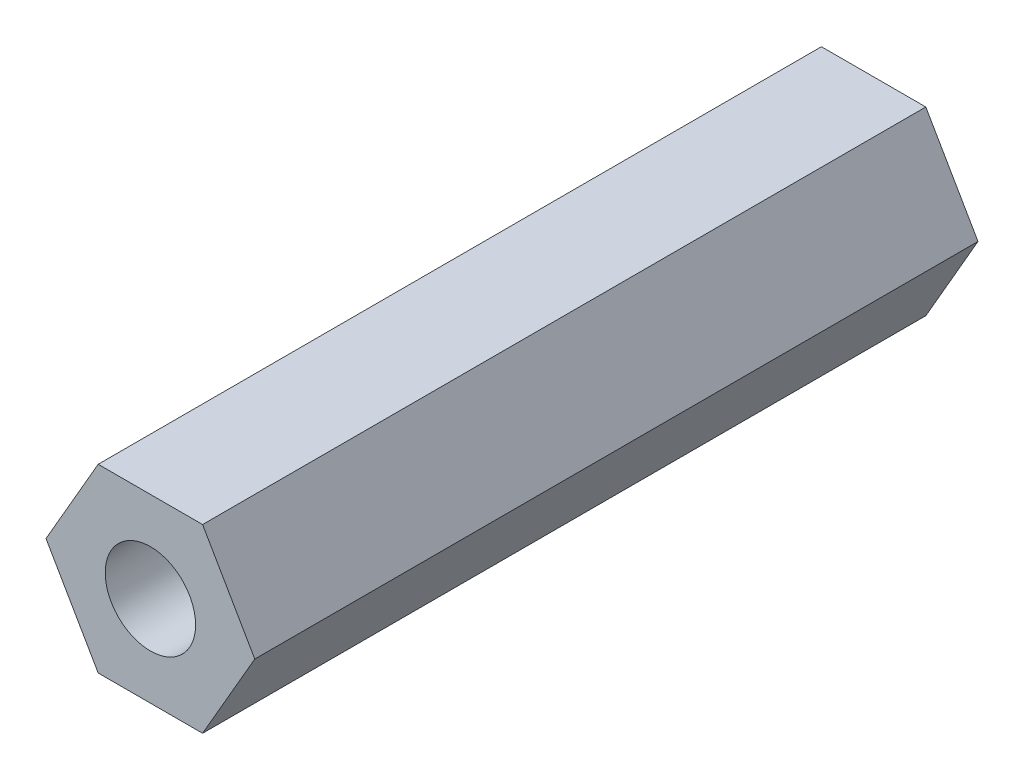
ISO-10303-21;
HEADER;
FILE_DESCRIPTION(('STEP AP214'),'2;1');
FILE_NAME('part.step','',(''),(''),'','','');
FILE_SCHEMA(('AUTOMOTIVE_DESIGN { 1 0 10303 214 1 1 1 1 }'));
ENDSEC;
DATA;
#1=APPLICATION_CONTEXT('core data for automotive mechanical design processes');
#2=APPLICATION_PROTOCOL_DEFINITION('international standard','automotive_design',2000,#1);
#3=PRODUCT_CONTEXT('',#1,'mechanical');
#4=PRODUCT('Part','Part','',(#3));
#5=PRODUCT_RELATED_PRODUCT_CATEGORY('part','',(#4));
#6=PRODUCT_DEFINITION_FORMATION('','',#4);
#7=PRODUCT_DEFINITION_CONTEXT('part definition',#1,'design');
#8=PRODUCT_DEFINITION('design','',#6,#7);
#9=PRODUCT_DEFINITION_SHAPE('','',#8);
#10=(LENGTH_UNIT() NAMED_UNIT(*) SI_UNIT(.MILLI.,.METRE.));
#11=(NAMED_UNIT(*) PLANE_ANGLE_UNIT() SI_UNIT($,.RADIAN.));
#12=(NAMED_UNIT(*) SI_UNIT($,.STERADIAN.) SOLID_ANGLE_UNIT());
#13=UNCERTAINTY_MEASURE_WITH_UNIT(LENGTH_MEASURE(1.E-05),#10,'distance_accuracy_value','');
#14=(GEOMETRIC_REPRESENTATION_CONTEXT(3) GLOBAL_UNCERTAINTY_ASSIGNED_CONTEXT((#13)) GLOBAL_UNIT_ASSIGNED_CONTEXT((#10,
#11,#12)) REPRESENTATION_CONTEXT('',''));
#15=CARTESIAN_POINT('',(0.,0.,0.));
#16=DIRECTION('',(0.,0.,1.));
#17=DIRECTION('',(1.,0.,0.));
#18=AXIS2_PLACEMENT_3D('',#15,#16,#17);
#19=CARTESIAN_POINT('',(1.44337567297406,2.5,20.));
#20=DIRECTION('',(0.,-1.,0.));
#21=DIRECTION('',(1.,0.,0.));
#22=AXIS2_PLACEMENT_3D('',#19,#20,#21);
#23=PLANE('',#22);
#24=DIRECTION('',(-1.,0.,0.));
#25=VECTOR('',#24,1.);
#26=CARTESIAN_POINT('',(1.44337567297406,2.5,0.));
#27=LINE('',#26,#25);
#28=CARTESIAN_POINT('',(1.44337567297406,2.5,0.));
#29=VERTEX_POINT('',#28);
#30=CARTESIAN_POINT('',(-1.44337567297407,2.5,0.));
#31=VERTEX_POINT('',#30);
#32=EDGE_CURVE('E116',#29,#31,#27,.T.);
#33=ORIENTED_EDGE('',*,*,#32,.T.);
#34=DIRECTION('',(0.,0.,-1.));
#35=VECTOR('',#34,1.);
#36=CARTESIAN_POINT('',(-1.44337567297407,2.5,20.));
#37=LINE('',#36,#35);
#38=CARTESIAN_POINT('',(-1.44337567297407,2.5,20.));
#39=VERTEX_POINT('',#38);
#40=EDGE_CURVE('E11',#39,#31,#37,.T.);
#41=ORIENTED_EDGE('',*,*,#40,.F.);
#42=DIRECTION('',(-1.,0.,0.));
#43=VECTOR('',#42,1.);
#44=CARTESIAN_POINT('',(1.44337567297406,2.5,20.));
#45=LINE('',#44,#43);
#46=CARTESIAN_POINT('',(1.44337567297406,2.5,20.));
#47=VERTEX_POINT('',#46);
#48=EDGE_CURVE('E127',#47,#39,#45,.T.);
#49=ORIENTED_EDGE('',*,*,#48,.F.);
#50=DIRECTION('',(0.,0.,-1.));
#51=VECTOR('',#50,1.);
#52=CARTESIAN_POINT('',(1.44337567297406,2.5,20.));
#53=LINE('',#52,#51);
#54=EDGE_CURVE('E112',#47,#29,#53,.T.);
#55=ORIENTED_EDGE('',*,*,#54,.T.);
#56=EDGE_LOOP('',(#33,#41,#49,#55));
#57=FACE_BOUND('',#56,.T.);
#58=ADVANCED_FACE('F32',(#57),#23,.F.);
#59=CARTESIAN_POINT('',(-1.44337567297407,2.5,20.));
#60=DIRECTION('',(0.866025403784439,-0.5,0.));
#61=DIRECTION('',(0.5,0.866025403784439,0.));
#62=AXIS2_PLACEMENT_3D('',#59,#60,#61);
#63=PLANE('',#62);
#64=DIRECTION('',(-0.5,-0.866025403784439,0.));
#65=VECTOR('',#64,1.);
#66=CARTESIAN_POINT('',(-1.44337567297407,2.5,0.));
#67=LINE('',#66,#65);
#68=CARTESIAN_POINT('',(-2.88675134594813,0.,0.));
#69=VERTEX_POINT('',#68);
#70=EDGE_CURVE('E119',#31,#69,#67,.T.);
#71=ORIENTED_EDGE('',*,*,#70,.T.);
#72=DIRECTION('',(0.,0.,-1.));
#73=VECTOR('',#72,1.);
#74=CARTESIAN_POINT('',(-2.88675134594813,0.,20.));
#75=LINE('',#74,#73);
#76=CARTESIAN_POINT('',(-2.88675134594813,0.,20.));
#77=VERTEX_POINT('',#76);
#78=EDGE_CURVE('E40',#77,#69,#75,.T.);
#79=ORIENTED_EDGE('',*,*,#78,.F.);
#80=DIRECTION('',(-0.5,-0.866025403784439,0.));
#81=VECTOR('',#80,1.);
#82=CARTESIAN_POINT('',(-1.44337567297407,2.5,20.));
#83=LINE('',#82,#81);
#84=EDGE_CURVE('E85',#39,#77,#83,.T.);
#85=ORIENTED_EDGE('',*,*,#84,.F.);
#86=ORIENTED_EDGE('',*,*,#40,.T.);
#87=EDGE_LOOP('',(#71,#79,#85,#86));
#88=FACE_BOUND('',#87,.T.);
#89=ADVANCED_FACE('F152',(#88),#63,.F.);
#90=CARTESIAN_POINT('',(-2.88675134594813,0.,20.));
#91=DIRECTION('',(0.866025403784438,0.5,0.));
#92=DIRECTION('',(-0.5,0.866025403784438,0.));
#93=AXIS2_PLACEMENT_3D('',#90,#91,#92);
#94=PLANE('',#93);
#95=DIRECTION('',(0.5,-0.866025403784438,0.));
#96=VECTOR('',#95,1.);
#97=CARTESIAN_POINT('',(-2.88675134594813,0.,0.));
#98=LINE('',#97,#96);
#99=CARTESIAN_POINT('',(-1.44337567297406,-2.5,0.));
#100=VERTEX_POINT('',#99);
#101=EDGE_CURVE('E122',#69,#100,#98,.T.);
#102=ORIENTED_EDGE('',*,*,#101,.T.);
#103=DIRECTION('',(0.,0.,-1.));
#104=VECTOR('',#103,1.);
#105=CARTESIAN_POINT('',(-1.44337567297406,-2.5,20.));
#106=LINE('',#105,#104);
#107=CARTESIAN_POINT('',(-1.44337567297406,-2.5,20.));
#108=VERTEX_POINT('',#107);
#109=EDGE_CURVE('E107',#108,#100,#106,.T.);
#110=ORIENTED_EDGE('',*,*,#109,.F.);
#111=DIRECTION('',(0.5,-0.866025403784438,0.));
#112=VECTOR('',#111,1.);
#113=CARTESIAN_POINT('',(-2.88675134594813,0.,20.));
#114=LINE('',#113,#112);
#115=EDGE_CURVE('E98',#77,#108,#114,.T.);
#116=ORIENTED_EDGE('',*,*,#115,.F.);
#117=ORIENTED_EDGE('',*,*,#78,.T.);
#118=EDGE_LOOP('',(#102,#110,#116,#117));
#119=FACE_BOUND('',#118,.T.);
#120=ADVANCED_FACE('F133',(#119),#94,.F.);
#121=CARTESIAN_POINT('',(-1.44337567297406,-2.5,20.));
#122=DIRECTION('',(0.,1.,0.));
#123=DIRECTION('',(-1.,0.,0.));
#124=AXIS2_PLACEMENT_3D('',#121,#122,#123);
#125=PLANE('',#124);
#126=DIRECTION('',(1.,0.,0.));
#127=VECTOR('',#126,1.);
#128=CARTESIAN_POINT('',(-1.44337567297406,-2.5,0.));
#129=LINE('',#128,#127);
#130=CARTESIAN_POINT('',(1.44337567297407,-2.5,0.));
#131=VERTEX_POINT('',#130);
#132=EDGE_CURVE('E106',#100,#131,#129,.T.);
#133=ORIENTED_EDGE('',*,*,#132,.T.);
#134=DIRECTION('',(0.,0.,-1.));
#135=VECTOR('',#134,1.);
#136=CARTESIAN_POINT('',(1.44337567297407,-2.5,20.));
#137=LINE('',#136,#135);
#138=CARTESIAN_POINT('',(1.44337567297407,-2.5,20.));
#139=VERTEX_POINT('',#138);
#140=EDGE_CURVE('E103',#139,#131,#137,.T.);
#141=ORIENTED_EDGE('',*,*,#140,.F.);
#142=DIRECTION('',(1.,0.,0.));
#143=VECTOR('',#142,1.);
#144=CARTESIAN_POINT('',(-1.44337567297406,-2.5,20.));
#145=LINE('',#144,#143);
#146=EDGE_CURVE('E92',#108,#139,#145,.T.);
#147=ORIENTED_EDGE('',*,*,#146,.F.);
#148=ORIENTED_EDGE('',*,*,#109,.T.);
#149=EDGE_LOOP('',(#133,#141,#147,#148));
#150=FACE_BOUND('',#149,.T.);
#151=ADVANCED_FACE('F104',(#150),#125,.F.);
#152=CARTESIAN_POINT('',(1.44337567297407,-2.5,20.));
#153=DIRECTION('',(-0.866025403784439,0.5,0.));
#154=DIRECTION('',(-0.5,-0.866025403784439,0.));
#155=AXIS2_PLACEMENT_3D('',#152,#153,#154);
#156=PLANE('',#155);
#157=DIRECTION('',(0.5,0.866025403784439,0.));
#158=VECTOR('',#157,1.);
#159=CARTESIAN_POINT('',(1.44337567297407,-2.5,0.));
#160=LINE('',#159,#158);
#161=CARTESIAN_POINT('',(2.88675134594813,0.,0.));
#162=VERTEX_POINT('',#161);
#163=EDGE_CURVE('E71',#131,#162,#160,.T.);
#164=ORIENTED_EDGE('',*,*,#163,.T.);
#165=DIRECTION('',(0.,0.,-1.));
#166=VECTOR('',#165,1.);
#167=CARTESIAN_POINT('',(2.88675134594813,0.,20.));
#168=LINE('',#167,#166);
#169=CARTESIAN_POINT('',(2.88675134594813,0.,20.));
#170=VERTEX_POINT('',#169);
#171=EDGE_CURVE('E108',#170,#162,#168,.T.);
#172=ORIENTED_EDGE('',*,*,#171,.F.);
#173=DIRECTION('',(0.5,0.866025403784439,0.));
#174=VECTOR('',#173,1.);
#175=CARTESIAN_POINT('',(1.44337567297407,-2.5,20.));
#176=LINE('',#175,#174);
#177=EDGE_CURVE('E96',#139,#170,#176,.T.);
#178=ORIENTED_EDGE('',*,*,#177,.F.);
#179=ORIENTED_EDGE('',*,*,#140,.T.);
#180=EDGE_LOOP('',(#164,#172,#178,#179));
#181=FACE_BOUND('',#180,.T.);
#182=ADVANCED_FACE('F110',(#181),#156,.F.);
#183=CARTESIAN_POINT('',(2.88675134594813,0.,20.));
#184=DIRECTION('',(-0.866025403784439,-0.5,0.));
#185=DIRECTION('',(0.5,-0.866025403784439,0.));
#186=AXIS2_PLACEMENT_3D('',#183,#184,#185);
#187=PLANE('',#186);
#188=DIRECTION('',(-0.5,0.866025403784439,0.));
#189=VECTOR('',#188,1.);
#190=CARTESIAN_POINT('',(2.88675134594813,0.,0.));
#191=LINE('',#190,#189);
#192=EDGE_CURVE('E77',#162,#29,#191,.T.);
#193=ORIENTED_EDGE('',*,*,#192,.T.);
#194=ORIENTED_EDGE('',*,*,#54,.F.);
#195=DIRECTION('',(-0.5,0.866025403784439,0.));
#196=VECTOR('',#195,1.);
#197=CARTESIAN_POINT('',(2.88675134594813,0.,20.));
#198=LINE('',#197,#196);
#199=EDGE_CURVE('E48',#170,#47,#198,.T.);
#200=ORIENTED_EDGE('',*,*,#199,.F.);
#201=ORIENTED_EDGE('',*,*,#171,.T.);
#202=EDGE_LOOP('',(#193,#194,#200,#201));
#203=FACE_BOUND('',#202,.T.);
#204=ADVANCED_FACE('F140',(#203),#187,.F.);
#205=CARTESIAN_POINT('',(0.,0.,20.));
#206=DIRECTION('',(0.,0.,1.));
#207=DIRECTION('',(1.,0.,0.));
#208=AXIS2_PLACEMENT_3D('',#205,#206,#207);
#209=PLANE('',#208);
#210=CARTESIAN_POINT('',(0.,0.,20.));
#211=DIRECTION('',(0.,0.,1.));
#212=DIRECTION('',(1.,0.,0.));
#213=AXIS2_PLACEMENT_3D('',#210,#211,#212);
#214=CIRCLE('',#213,1.24999999999999);
#215=CARTESIAN_POINT('',(1.24999999999999,0.,20.));
#216=VERTEX_POINT('',#215);
#217=EDGE_CURVE('E207',#216,#216,#214,.T.);
#218=ORIENTED_EDGE('',*,*,#217,.F.);
#219=EDGE_LOOP('',(#218));
#220=FACE_BOUND('',#219,.T.);
#221=ORIENTED_EDGE('',*,*,#48,.T.);
#222=ORIENTED_EDGE('',*,*,#84,.T.);
#223=ORIENTED_EDGE('',*,*,#115,.T.);
#224=ORIENTED_EDGE('',*,*,#146,.T.);
#225=ORIENTED_EDGE('',*,*,#177,.T.);
#226=ORIENTED_EDGE('',*,*,#199,.T.);
#227=EDGE_LOOP('',(#221,#222,#223,#224,#225,#226));
#228=FACE_BOUND('',#227,.T.);
#229=ADVANCED_FACE('F94',(#220,#228),#209,.T.);
#230=CARTESIAN_POINT('',(0.,0.,0.));
#231=DIRECTION('',(0.,0.,1.));
#232=DIRECTION('',(1.,0.,0.));
#233=AXIS2_PLACEMENT_3D('',#230,#231,#232);
#234=PLANE('',#233);
#235=CARTESIAN_POINT('',(0.,0.,0.));
#236=DIRECTION('',(0.,0.,1.));
#237=DIRECTION('',(1.,0.,0.));
#238=AXIS2_PLACEMENT_3D('',#235,#236,#237);
#239=CIRCLE('',#238,1.25);
#240=CARTESIAN_POINT('',(1.25,0.,0.));
#241=VERTEX_POINT('',#240);
#242=EDGE_CURVE('E120',#241,#241,#239,.T.);
#243=ORIENTED_EDGE('',*,*,#242,.T.);
#244=EDGE_LOOP('',(#243));
#245=FACE_BOUND('',#244,.T.);
#246=ORIENTED_EDGE('',*,*,#32,.F.);
#247=ORIENTED_EDGE('',*,*,#192,.F.);
#248=ORIENTED_EDGE('',*,*,#163,.F.);
#249=ORIENTED_EDGE('',*,*,#132,.F.);
#250=ORIENTED_EDGE('',*,*,#101,.F.);
#251=ORIENTED_EDGE('',*,*,#70,.F.);
#252=EDGE_LOOP('',(#246,#247,#248,#249,#250,#251));
#253=FACE_BOUND('',#252,.T.);
#254=ADVANCED_FACE('F136',(#245,#253),#234,.F.);
#255=CARTESIAN_POINT('',(0.,0.,20.));
#256=DIRECTION('',(0.,0.,1.));
#257=DIRECTION('',(1.,0.,0.));
#258=AXIS2_PLACEMENT_3D('',#255,#256,#257);
#259=CYLINDRICAL_SURFACE('',#258,1.24999999999999);
#260=ORIENTED_EDGE('',*,*,#242,.F.);
#261=EDGE_LOOP('',(#260));
#262=FACE_BOUND('',#261,.T.);
#263=ORIENTED_EDGE('',*,*,#217,.T.);
#264=EDGE_LOOP('',(#263));
#265=FACE_BOUND('',#264,.T.);
#266=ADVANCED_FACE('F189',(#262,#265),#259,.F.);
#267=CLOSED_SHELL('',(#58,#89,#120,#151,#182,#204,#229,#254,#266));
#268=MANIFOLD_SOLID_BREP('B2',#267);
#269=ADVANCED_BREP_SHAPE_REPRESENTATION('',(#18,#268),#14);
#270=SHAPE_DEFINITION_REPRESENTATION(#9,#269);
ENDSEC;
END-ISO-10303-21;
